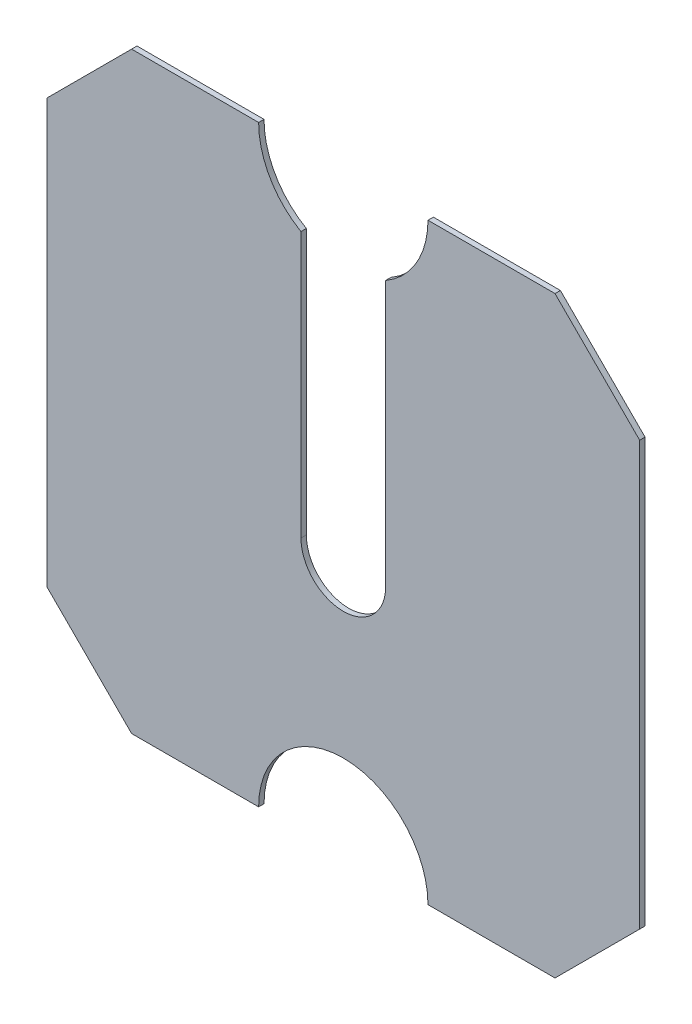
ISO-10303-21;
HEADER;
FILE_DESCRIPTION(('STEP AP214'),'2;1');
FILE_NAME('part.step','',(''),(''),'','','');
FILE_SCHEMA(('AUTOMOTIVE_DESIGN { 1 0 10303 214 1 1 1 1 }'));
ENDSEC;
DATA;
#1=APPLICATION_CONTEXT('core data for automotive mechanical design processes');
#2=APPLICATION_PROTOCOL_DEFINITION('international standard','automotive_design',2000,#1);
#3=PRODUCT_CONTEXT('',#1,'mechanical');
#4=PRODUCT('Part','Part','',(#3));
#5=PRODUCT_RELATED_PRODUCT_CATEGORY('part','',(#4));
#6=PRODUCT_DEFINITION_FORMATION('','',#4);
#7=PRODUCT_DEFINITION_CONTEXT('part definition',#1,'design');
#8=PRODUCT_DEFINITION('design','',#6,#7);
#9=PRODUCT_DEFINITION_SHAPE('','',#8);
#10=(LENGTH_UNIT() NAMED_UNIT(*) SI_UNIT(.MILLI.,.METRE.));
#11=(NAMED_UNIT(*) PLANE_ANGLE_UNIT() SI_UNIT($,.RADIAN.));
#12=(NAMED_UNIT(*) SI_UNIT($,.STERADIAN.) SOLID_ANGLE_UNIT());
#13=UNCERTAINTY_MEASURE_WITH_UNIT(LENGTH_MEASURE(1.E-05),#10,'distance_accuracy_value','');
#14=(GEOMETRIC_REPRESENTATION_CONTEXT(3) GLOBAL_UNCERTAINTY_ASSIGNED_CONTEXT((#13)) GLOBAL_UNIT_ASSIGNED_CONTEXT((#10,
#11,#12)) REPRESENTATION_CONTEXT('',''));
#15=CARTESIAN_POINT('',(0.,0.,0.));
#16=DIRECTION('',(0.,0.,1.));
#17=DIRECTION('',(1.,0.,0.));
#18=AXIS2_PLACEMENT_3D('',#15,#16,#17);
#19=CARTESIAN_POINT('',(0.,350.,3.175));
#20=DIRECTION('',(0.,0.,-1.));
#21=DIRECTION('',(-1.,0.,0.));
#22=AXIS2_PLACEMENT_3D('',#19,#20,#21);
#23=CYLINDRICAL_SURFACE('',#22,50.);
#24=CARTESIAN_POINT('',(0.,350.,0.));
#25=DIRECTION('',(0.,0.,-1.));
#26=DIRECTION('',(-1.,0.,0.));
#27=AXIS2_PLACEMENT_3D('',#24,#25,#26);
#28=CIRCLE('',#27,50.);
#29=CARTESIAN_POINT('',(50.,350.,0.));
#30=VERTEX_POINT('',#29);
#31=CARTESIAN_POINT('',(25.,306.698729810778,0.));
#32=VERTEX_POINT('',#31);
#33=EDGE_CURVE('E178',#30,#32,#28,.T.);
#34=ORIENTED_EDGE('',*,*,#33,.T.);
#35=DIRECTION('',(0.,0.,1.));
#36=VECTOR('',#35,1.);
#37=CARTESIAN_POINT('',(25.,306.698729810778,0.));
#38=LINE('',#37,#36);
#39=CARTESIAN_POINT('',(25.,306.698729810778,3.175));
#40=VERTEX_POINT('',#39);
#41=EDGE_CURVE('E171',#32,#40,#38,.T.);
#42=ORIENTED_EDGE('',*,*,#41,.T.);
#43=CARTESIAN_POINT('',(0.,350.,3.175));
#44=DIRECTION('',(0.,0.,-1.));
#45=DIRECTION('',(-1.,0.,0.));
#46=AXIS2_PLACEMENT_3D('',#43,#44,#45);
#47=CIRCLE('',#46,50.);
#48=CARTESIAN_POINT('',(50.,350.,3.175));
#49=VERTEX_POINT('',#48);
#50=EDGE_CURVE('E235',#49,#40,#47,.T.);
#51=ORIENTED_EDGE('',*,*,#50,.F.);
#52=DIRECTION('',(0.,0.,-1.));
#53=VECTOR('',#52,1.);
#54=CARTESIAN_POINT('',(50.,350.,3.175));
#55=LINE('',#54,#53);
#56=EDGE_CURVE('E209',#49,#30,#55,.T.);
#57=ORIENTED_EDGE('',*,*,#56,.T.);
#58=EDGE_LOOP('',(#34,#42,#51,#57));
#59=FACE_BOUND('',#58,.T.);
#60=ADVANCED_FACE('F33',(#59),#23,.F.);
#61=CARTESIAN_POINT('',(175.,50.,3.175));
#62=DIRECTION('',(-0.707106781186548,0.707106781186547,0.));
#63=DIRECTION('',(-0.707106781186547,-0.707106781186548,0.));
#64=AXIS2_PLACEMENT_3D('',#61,#62,#63);
#65=PLANE('',#64);
#66=DIRECTION('',(0.707106781186547,0.707106781186548,0.));
#67=VECTOR('',#66,1.);
#68=CARTESIAN_POINT('',(175.,50.,0.));
#69=LINE('',#68,#67);
#70=CARTESIAN_POINT('',(125.,0.,0.));
#71=VERTEX_POINT('',#70);
#72=CARTESIAN_POINT('',(175.,50.,0.));
#73=VERTEX_POINT('',#72);
#74=EDGE_CURVE('E167',#71,#73,#69,.T.);
#75=ORIENTED_EDGE('',*,*,#74,.T.);
#76=DIRECTION('',(0.,0.,-1.));
#77=VECTOR('',#76,1.);
#78=CARTESIAN_POINT('',(175.,50.,3.175));
#79=LINE('',#78,#77);
#80=CARTESIAN_POINT('',(175.,50.,3.175));
#81=VERTEX_POINT('',#80);
#82=EDGE_CURVE('E11',#81,#73,#79,.T.);
#83=ORIENTED_EDGE('',*,*,#82,.F.);
#84=DIRECTION('',(0.707106781186547,0.707106781186548,0.));
#85=VECTOR('',#84,1.);
#86=CARTESIAN_POINT('',(175.,50.,3.175));
#87=LINE('',#86,#85);
#88=CARTESIAN_POINT('',(125.,0.,3.175));
#89=VERTEX_POINT('',#88);
#90=EDGE_CURVE('E193',#89,#81,#87,.T.);
#91=ORIENTED_EDGE('',*,*,#90,.F.);
#92=DIRECTION('',(0.,0.,-1.));
#93=VECTOR('',#92,1.);
#94=CARTESIAN_POINT('',(125.,0.,3.175));
#95=LINE('',#94,#93);
#96=EDGE_CURVE('E163',#89,#71,#95,.T.);
#97=ORIENTED_EDGE('',*,*,#96,.T.);
#98=EDGE_LOOP('',(#75,#83,#91,#97));
#99=FACE_BOUND('',#98,.T.);
#100=ADVANCED_FACE('F35',(#99),#65,.F.);
#101=CARTESIAN_POINT('',(175.,300.,3.175));
#102=DIRECTION('',(-1.,0.,0.));
#103=DIRECTION('',(0.,-1.,0.));
#104=AXIS2_PLACEMENT_3D('',#101,#102,#103);
#105=PLANE('',#104);
#106=DIRECTION('',(0.,1.,0.));
#107=VECTOR('',#106,1.);
#108=CARTESIAN_POINT('',(175.,300.,0.));
#109=LINE('',#108,#107);
#110=CARTESIAN_POINT('',(175.,300.,0.));
#111=VERTEX_POINT('',#110);
#112=EDGE_CURVE('E170',#73,#111,#109,.T.);
#113=ORIENTED_EDGE('',*,*,#112,.T.);
#114=DIRECTION('',(0.,0.,-1.));
#115=VECTOR('',#114,1.);
#116=CARTESIAN_POINT('',(175.,300.,3.175));
#117=LINE('',#116,#115);
#118=CARTESIAN_POINT('',(175.,300.,3.175));
#119=VERTEX_POINT('',#118);
#120=EDGE_CURVE('E41',#119,#111,#117,.T.);
#121=ORIENTED_EDGE('',*,*,#120,.F.);
#122=DIRECTION('',(0.,1.,0.));
#123=VECTOR('',#122,1.);
#124=CARTESIAN_POINT('',(175.,300.,3.175));
#125=LINE('',#124,#123);
#126=EDGE_CURVE('E110',#81,#119,#125,.T.);
#127=ORIENTED_EDGE('',*,*,#126,.F.);
#128=ORIENTED_EDGE('',*,*,#82,.T.);
#129=EDGE_LOOP('',(#113,#121,#127,#128));
#130=FACE_BOUND('',#129,.T.);
#131=ADVANCED_FACE('F329',(#130),#105,.F.);
#132=CARTESIAN_POINT('',(175.,300.,3.175));
#133=DIRECTION('',(-0.707106781186548,-0.707106781186547,0.));
#134=DIRECTION('',(0.707106781186547,-0.707106781186548,0.));
#135=AXIS2_PLACEMENT_3D('',#132,#133,#134);
#136=PLANE('',#135);
#137=DIRECTION('',(-0.707106781186547,0.707106781186548,0.));
#138=VECTOR('',#137,1.);
#139=CARTESIAN_POINT('',(175.,300.,0.));
#140=LINE('',#139,#138);
#141=CARTESIAN_POINT('',(125.,350.,0.));
#142=VERTEX_POINT('',#141);
#143=EDGE_CURVE('E173',#111,#142,#140,.T.);
#144=ORIENTED_EDGE('',*,*,#143,.T.);
#145=DIRECTION('',(0.,0.,-1.));
#146=VECTOR('',#145,1.);
#147=CARTESIAN_POINT('',(125.,350.,3.175));
#148=LINE('',#147,#146);
#149=CARTESIAN_POINT('',(125.,350.,3.175));
#150=VERTEX_POINT('',#149);
#151=EDGE_CURVE('E212',#150,#142,#148,.T.);
#152=ORIENTED_EDGE('',*,*,#151,.F.);
#153=DIRECTION('',(-0.707106781186547,0.707106781186548,0.));
#154=VECTOR('',#153,1.);
#155=CARTESIAN_POINT('',(175.,300.,3.175));
#156=LINE('',#155,#154);
#157=EDGE_CURVE('E220',#119,#150,#156,.T.);
#158=ORIENTED_EDGE('',*,*,#157,.F.);
#159=ORIENTED_EDGE('',*,*,#120,.T.);
#160=EDGE_LOOP('',(#144,#152,#158,#159));
#161=FACE_BOUND('',#160,.T.);
#162=ADVANCED_FACE('F218',(#161),#136,.F.);
#163=CARTESIAN_POINT('',(125.,350.,3.175));
#164=DIRECTION('',(0.,-1.,0.));
#165=DIRECTION('',(0.,0.,-1.));
#166=AXIS2_PLACEMENT_3D('',#163,#164,#165);
#167=PLANE('',#166);
#168=DIRECTION('',(-1.,0.,0.));
#169=VECTOR('',#168,1.);
#170=CARTESIAN_POINT('',(125.,350.,0.));
#171=LINE('',#170,#169);
#172=EDGE_CURVE('E175',#142,#30,#171,.T.);
#173=ORIENTED_EDGE('',*,*,#172,.T.);
#174=ORIENTED_EDGE('',*,*,#56,.F.);
#175=DIRECTION('',(-1.,0.,0.));
#176=VECTOR('',#175,1.);
#177=CARTESIAN_POINT('',(125.,350.,3.175));
#178=LINE('',#177,#176);
#179=EDGE_CURVE('E242',#150,#49,#178,.T.);
#180=ORIENTED_EDGE('',*,*,#179,.F.);
#181=ORIENTED_EDGE('',*,*,#151,.T.);
#182=EDGE_LOOP('',(#173,#174,#180,#181));
#183=FACE_BOUND('',#182,.T.);
#184=ADVANCED_FACE('F229',(#183),#167,.F.);
#185=CARTESIAN_POINT('',(-25.,306.698729810778,3.175));
#186=VERTEX_POINT('',#185);
#187=CARTESIAN_POINT('',(-50.,350.,3.175));
#188=VERTEX_POINT('',#187);
#189=EDGE_CURVE('E238',#186,#188,#47,.T.);
#190=ORIENTED_EDGE('',*,*,#189,.F.);
#191=DIRECTION('',(0.,0.,1.));
#192=VECTOR('',#191,1.);
#193=CARTESIAN_POINT('',(-25.,306.698729810778,0.));
#194=LINE('',#193,#192);
#195=CARTESIAN_POINT('',(-25.,306.698729810778,0.));
#196=VERTEX_POINT('',#195);
#197=EDGE_CURVE('E265',#196,#186,#194,.T.);
#198=ORIENTED_EDGE('',*,*,#197,.F.);
#199=CARTESIAN_POINT('',(-50.,350.,0.));
#200=VERTEX_POINT('',#199);
#201=EDGE_CURVE('E177',#196,#200,#28,.T.);
#202=ORIENTED_EDGE('',*,*,#201,.T.);
#203=DIRECTION('',(0.,0.,-1.));
#204=VECTOR('',#203,1.);
#205=CARTESIAN_POINT('',(-50.,350.,3.175));
#206=LINE('',#205,#204);
#207=EDGE_CURVE('E206',#188,#200,#206,.T.);
#208=ORIENTED_EDGE('',*,*,#207,.F.);
#209=EDGE_LOOP('',(#190,#198,#202,#208));
#210=FACE_BOUND('',#209,.T.);
#211=ADVANCED_FACE('F301',(#210),#23,.F.);
#212=CARTESIAN_POINT('',(-125.,350.,3.175));
#213=DIRECTION('',(0.,-1.,0.));
#214=DIRECTION('',(0.,0.,-1.));
#215=AXIS2_PLACEMENT_3D('',#212,#213,#214);
#216=PLANE('',#215);
#217=DIRECTION('',(-1.,0.,0.));
#218=VECTOR('',#217,1.);
#219=CARTESIAN_POINT('',(-125.,350.,0.));
#220=LINE('',#219,#218);
#221=CARTESIAN_POINT('',(-125.,350.,0.));
#222=VERTEX_POINT('',#221);
#223=EDGE_CURVE('E181',#200,#222,#220,.T.);
#224=ORIENTED_EDGE('',*,*,#223,.T.);
#225=DIRECTION('',(0.,0.,-1.));
#226=VECTOR('',#225,1.);
#227=CARTESIAN_POINT('',(-125.,350.,3.175));
#228=LINE('',#227,#226);
#229=CARTESIAN_POINT('',(-125.,350.,3.175));
#230=VERTEX_POINT('',#229);
#231=EDGE_CURVE('E203',#230,#222,#228,.T.);
#232=ORIENTED_EDGE('',*,*,#231,.F.);
#233=DIRECTION('',(-1.,0.,0.));
#234=VECTOR('',#233,1.);
#235=CARTESIAN_POINT('',(-125.,350.,3.175));
#236=LINE('',#235,#234);
#237=EDGE_CURVE('E237',#188,#230,#236,.T.);
#238=ORIENTED_EDGE('',*,*,#237,.F.);
#239=ORIENTED_EDGE('',*,*,#207,.T.);
#240=EDGE_LOOP('',(#224,#232,#238,#239));
#241=FACE_BOUND('',#240,.T.);
#242=ADVANCED_FACE('F333',(#241),#216,.F.);
#243=CARTESIAN_POINT('',(-175.,300.,3.175));
#244=DIRECTION('',(0.707106781186547,-0.707106781186548,0.));
#245=DIRECTION('',(0.707106781186548,0.707106781186547,0.));
#246=AXIS2_PLACEMENT_3D('',#243,#244,#245);
#247=PLANE('',#246);
#248=DIRECTION('',(-0.707106781186548,-0.707106781186547,0.));
#249=VECTOR('',#248,1.);
#250=CARTESIAN_POINT('',(-175.,300.,0.));
#251=LINE('',#250,#249);
#252=CARTESIAN_POINT('',(-175.,300.,0.));
#253=VERTEX_POINT('',#252);
#254=EDGE_CURVE('E183',#222,#253,#251,.T.);
#255=ORIENTED_EDGE('',*,*,#254,.T.);
#256=DIRECTION('',(0.,0.,-1.));
#257=VECTOR('',#256,1.);
#258=CARTESIAN_POINT('',(-175.,300.,3.175));
#259=LINE('',#258,#257);
#260=CARTESIAN_POINT('',(-175.,300.,3.175));
#261=VERTEX_POINT('',#260);
#262=EDGE_CURVE('E200',#261,#253,#259,.T.);
#263=ORIENTED_EDGE('',*,*,#262,.F.);
#264=DIRECTION('',(-0.707106781186548,-0.707106781186547,0.));
#265=VECTOR('',#264,1.);
#266=CARTESIAN_POINT('',(-175.,300.,3.175));
#267=LINE('',#266,#265);
#268=EDGE_CURVE('E240',#230,#261,#267,.T.);
#269=ORIENTED_EDGE('',*,*,#268,.F.);
#270=ORIENTED_EDGE('',*,*,#231,.T.);
#271=EDGE_LOOP('',(#255,#263,#269,#270));
#272=FACE_BOUND('',#271,.T.);
#273=ADVANCED_FACE('F338',(#272),#247,.F.);
#274=CARTESIAN_POINT('',(-175.,300.,3.175));
#275=DIRECTION('',(1.,0.,0.));
#276=DIRECTION('',(0.,0.,-1.));
#277=AXIS2_PLACEMENT_3D('',#274,#275,#276);
#278=PLANE('',#277);
#279=DIRECTION('',(0.,-1.,0.));
#280=VECTOR('',#279,1.);
#281=CARTESIAN_POINT('',(-175.,300.,0.));
#282=LINE('',#281,#280);
#283=CARTESIAN_POINT('',(-175.,50.0000000000001,0.));
#284=VERTEX_POINT('',#283);
#285=EDGE_CURVE('E185',#253,#284,#282,.T.);
#286=ORIENTED_EDGE('',*,*,#285,.T.);
#287=DIRECTION('',(0.,0.,-1.));
#288=VECTOR('',#287,1.);
#289=CARTESIAN_POINT('',(-175.,50.0000000000001,3.175));
#290=LINE('',#289,#288);
#291=CARTESIAN_POINT('',(-175.,50.0000000000001,3.175));
#292=VERTEX_POINT('',#291);
#293=EDGE_CURVE('E197',#292,#284,#290,.T.);
#294=ORIENTED_EDGE('',*,*,#293,.F.);
#295=DIRECTION('',(0.,-1.,0.));
#296=VECTOR('',#295,1.);
#297=CARTESIAN_POINT('',(-175.,300.,3.175));
#298=LINE('',#297,#296);
#299=EDGE_CURVE('E247',#261,#292,#298,.T.);
#300=ORIENTED_EDGE('',*,*,#299,.F.);
#301=ORIENTED_EDGE('',*,*,#262,.T.);
#302=EDGE_LOOP('',(#286,#294,#300,#301));
#303=FACE_BOUND('',#302,.T.);
#304=ADVANCED_FACE('F253',(#303),#278,.F.);
#305=CARTESIAN_POINT('',(-175.,50.0000000000001,3.175));
#306=DIRECTION('',(0.707106781186548,0.707106781186547,0.));
#307=DIRECTION('',(-0.707106781186547,0.707106781186548,0.));
#308=AXIS2_PLACEMENT_3D('',#305,#306,#307);
#309=PLANE('',#308);
#310=DIRECTION('',(0.707106781186547,-0.707106781186548,0.));
#311=VECTOR('',#310,1.);
#312=CARTESIAN_POINT('',(-175.,50.0000000000001,0.));
#313=LINE('',#312,#311);
#314=CARTESIAN_POINT('',(-125.,0.,0.));
#315=VERTEX_POINT('',#314);
#316=EDGE_CURVE('E187',#284,#315,#313,.T.);
#317=ORIENTED_EDGE('',*,*,#316,.T.);
#318=DIRECTION('',(0.,0.,-1.));
#319=VECTOR('',#318,1.);
#320=CARTESIAN_POINT('',(-125.,0.,3.175));
#321=LINE('',#320,#319);
#322=CARTESIAN_POINT('',(-125.,0.,3.175));
#323=VERTEX_POINT('',#322);
#324=EDGE_CURVE('E158',#323,#315,#321,.T.);
#325=ORIENTED_EDGE('',*,*,#324,.F.);
#326=DIRECTION('',(0.707106781186547,-0.707106781186548,0.));
#327=VECTOR('',#326,1.);
#328=CARTESIAN_POINT('',(-175.,50.0000000000001,3.175));
#329=LINE('',#328,#327);
#330=EDGE_CURVE('E146',#292,#323,#329,.T.);
#331=ORIENTED_EDGE('',*,*,#330,.F.);
#332=ORIENTED_EDGE('',*,*,#293,.T.);
#333=EDGE_LOOP('',(#317,#325,#331,#332));
#334=FACE_BOUND('',#333,.T.);
#335=ADVANCED_FACE('F257',(#334),#309,.F.);
#336=CARTESIAN_POINT('',(-125.,0.,3.175));
#337=DIRECTION('',(0.,1.,0.));
#338=DIRECTION('',(-1.,0.,0.));
#339=AXIS2_PLACEMENT_3D('',#336,#337,#338);
#340=PLANE('',#339);
#341=DIRECTION('',(1.,0.,0.));
#342=VECTOR('',#341,1.);
#343=CARTESIAN_POINT('',(-125.,0.,0.));
#344=LINE('',#343,#342);
#345=CARTESIAN_POINT('',(-50.,0.,0.));
#346=VERTEX_POINT('',#345);
#347=EDGE_CURVE('E155',#315,#346,#344,.T.);
#348=ORIENTED_EDGE('',*,*,#347,.T.);
#349=DIRECTION('',(0.,0.,-1.));
#350=VECTOR('',#349,1.);
#351=CARTESIAN_POINT('',(-50.,0.,3.175));
#352=LINE('',#351,#350);
#353=CARTESIAN_POINT('',(-50.,0.,3.175));
#354=VERTEX_POINT('',#353);
#355=EDGE_CURVE('E152',#354,#346,#352,.T.);
#356=ORIENTED_EDGE('',*,*,#355,.F.);
#357=DIRECTION('',(1.,0.,0.));
#358=VECTOR('',#357,1.);
#359=CARTESIAN_POINT('',(-125.,0.,3.175));
#360=LINE('',#359,#358);
#361=EDGE_CURVE('E138',#323,#354,#360,.T.);
#362=ORIENTED_EDGE('',*,*,#361,.F.);
#363=ORIENTED_EDGE('',*,*,#324,.T.);
#364=EDGE_LOOP('',(#348,#356,#362,#363));
#365=FACE_BOUND('',#364,.T.);
#366=ADVANCED_FACE('F153',(#365),#340,.F.);
#367=CARTESIAN_POINT('',(0.,0.,3.175));
#368=DIRECTION('',(0.,0.,-1.));
#369=DIRECTION('',(-1.,0.,0.));
#370=AXIS2_PLACEMENT_3D('',#367,#368,#369);
#371=CYLINDRICAL_SURFACE('',#370,50.);
#372=CARTESIAN_POINT('',(0.,0.,0.));
#373=DIRECTION('',(0.,0.,-1.));
#374=DIRECTION('',(1.,0.,0.));
#375=AXIS2_PLACEMENT_3D('',#372,#373,#374);
#376=CIRCLE('',#375,50.);
#377=CARTESIAN_POINT('',(50.,0.,0.));
#378=VERTEX_POINT('',#377);
#379=EDGE_CURVE('E190',#346,#378,#376,.T.);
#380=ORIENTED_EDGE('',*,*,#379,.T.);
#381=DIRECTION('',(0.,0.,-1.));
#382=VECTOR('',#381,1.);
#383=CARTESIAN_POINT('',(50.,0.,3.175));
#384=LINE('',#383,#382);
#385=CARTESIAN_POINT('',(50.,0.,3.175));
#386=VERTEX_POINT('',#385);
#387=EDGE_CURVE('E159',#386,#378,#384,.T.);
#388=ORIENTED_EDGE('',*,*,#387,.F.);
#389=CARTESIAN_POINT('',(0.,0.,3.175));
#390=DIRECTION('',(0.,0.,-1.));
#391=DIRECTION('',(1.,0.,0.));
#392=AXIS2_PLACEMENT_3D('',#389,#390,#391);
#393=CIRCLE('',#392,50.);
#394=EDGE_CURVE('E143',#354,#386,#393,.T.);
#395=ORIENTED_EDGE('',*,*,#394,.F.);
#396=ORIENTED_EDGE('',*,*,#355,.T.);
#397=EDGE_LOOP('',(#380,#388,#395,#396));
#398=FACE_BOUND('',#397,.T.);
#399=ADVANCED_FACE('F161',(#398),#371,.F.);
#400=CARTESIAN_POINT('',(125.,0.,3.175));
#401=DIRECTION('',(0.,1.,0.));
#402=DIRECTION('',(-1.,0.,0.));
#403=AXIS2_PLACEMENT_3D('',#400,#401,#402);
#404=PLANE('',#403);
#405=DIRECTION('',(1.,0.,0.));
#406=VECTOR('',#405,1.);
#407=CARTESIAN_POINT('',(125.,0.,0.));
#408=LINE('',#407,#406);
#409=EDGE_CURVE('E102',#378,#71,#408,.T.);
#410=ORIENTED_EDGE('',*,*,#409,.T.);
#411=ORIENTED_EDGE('',*,*,#96,.F.);
#412=DIRECTION('',(1.,0.,0.));
#413=VECTOR('',#412,1.);
#414=CARTESIAN_POINT('',(125.,0.,3.175));
#415=LINE('',#414,#413);
#416=EDGE_CURVE('E57',#386,#89,#415,.T.);
#417=ORIENTED_EDGE('',*,*,#416,.F.);
#418=ORIENTED_EDGE('',*,*,#387,.T.);
#419=EDGE_LOOP('',(#410,#411,#417,#418));
#420=FACE_BOUND('',#419,.T.);
#421=ADVANCED_FACE('F258',(#420),#404,.F.);
#422=CARTESIAN_POINT('',(0.,0.,3.175));
#423=DIRECTION('',(0.,0.,1.));
#424=DIRECTION('',(1.,0.,0.));
#425=AXIS2_PLACEMENT_3D('',#422,#423,#424);
#426=PLANE('',#425);
#427=DIRECTION('',(0.,1.,0.));
#428=VECTOR('',#427,1.);
#429=CARTESIAN_POINT('',(25.,150.,3.175));
#430=LINE('',#429,#428);
#431=CARTESIAN_POINT('',(25.,150.,3.175));
#432=VERTEX_POINT('',#431);
#433=EDGE_CURVE('E275',#432,#40,#430,.T.);
#434=ORIENTED_EDGE('',*,*,#433,.F.);
#435=CARTESIAN_POINT('',(0.,150.,3.175));
#436=DIRECTION('',(0.,0.,1.));
#437=DIRECTION('',(1.,0.,0.));
#438=AXIS2_PLACEMENT_3D('',#435,#436,#437);
#439=CIRCLE('',#438,25.);
#440=CARTESIAN_POINT('',(-25.,150.,3.175));
#441=VERTEX_POINT('',#440);
#442=EDGE_CURVE('E279',#441,#432,#439,.T.);
#443=ORIENTED_EDGE('',*,*,#442,.F.);
#444=DIRECTION('',(0.,-1.,0.));
#445=VECTOR('',#444,1.);
#446=CARTESIAN_POINT('',(-25.,306.698729810778,3.175));
#447=LINE('',#446,#445);
#448=EDGE_CURVE('E282',#186,#441,#447,.T.);
#449=ORIENTED_EDGE('',*,*,#448,.F.);
#450=ORIENTED_EDGE('',*,*,#189,.T.);
#451=ORIENTED_EDGE('',*,*,#237,.T.);
#452=ORIENTED_EDGE('',*,*,#268,.T.);
#453=ORIENTED_EDGE('',*,*,#299,.T.);
#454=ORIENTED_EDGE('',*,*,#330,.T.);
#455=ORIENTED_EDGE('',*,*,#361,.T.);
#456=ORIENTED_EDGE('',*,*,#394,.T.);
#457=ORIENTED_EDGE('',*,*,#416,.T.);
#458=ORIENTED_EDGE('',*,*,#90,.T.);
#459=ORIENTED_EDGE('',*,*,#126,.T.);
#460=ORIENTED_EDGE('',*,*,#157,.T.);
#461=ORIENTED_EDGE('',*,*,#179,.T.);
#462=ORIENTED_EDGE('',*,*,#50,.T.);
#463=EDGE_LOOP('',(#434,#443,#449,#450,#451,#452,#453,#454,#455,#456,#457,#458,#459,#460,#461,#462));
#464=FACE_BOUND('',#463,.T.);
#465=ADVANCED_FACE('F141',(#464),#426,.T.);
#466=CARTESIAN_POINT('',(0.,0.,0.));
#467=DIRECTION('',(0.,0.,1.));
#468=DIRECTION('',(1.,0.,0.));
#469=AXIS2_PLACEMENT_3D('',#466,#467,#468);
#470=PLANE('',#469);
#471=CARTESIAN_POINT('',(0.,150.,0.));
#472=DIRECTION('',(0.,0.,1.));
#473=DIRECTION('',(1.,0.,0.));
#474=AXIS2_PLACEMENT_3D('',#471,#472,#473);
#475=CIRCLE('',#474,25.);
#476=CARTESIAN_POINT('',(-25.,150.,0.));
#477=VERTEX_POINT('',#476);
#478=CARTESIAN_POINT('',(25.,150.,0.));
#479=VERTEX_POINT('',#478);
#480=EDGE_CURVE('E48',#477,#479,#475,.T.);
#481=ORIENTED_EDGE('',*,*,#480,.T.);
#482=DIRECTION('',(0.,1.,0.));
#483=VECTOR('',#482,1.);
#484=CARTESIAN_POINT('',(25.,150.,0.));
#485=LINE('',#484,#483);
#486=EDGE_CURVE('E269',#479,#32,#485,.T.);
#487=ORIENTED_EDGE('',*,*,#486,.T.);
#488=ORIENTED_EDGE('',*,*,#33,.F.);
#489=ORIENTED_EDGE('',*,*,#172,.F.);
#490=ORIENTED_EDGE('',*,*,#143,.F.);
#491=ORIENTED_EDGE('',*,*,#112,.F.);
#492=ORIENTED_EDGE('',*,*,#74,.F.);
#493=ORIENTED_EDGE('',*,*,#409,.F.);
#494=ORIENTED_EDGE('',*,*,#379,.F.);
#495=ORIENTED_EDGE('',*,*,#347,.F.);
#496=ORIENTED_EDGE('',*,*,#316,.F.);
#497=ORIENTED_EDGE('',*,*,#285,.F.);
#498=ORIENTED_EDGE('',*,*,#254,.F.);
#499=ORIENTED_EDGE('',*,*,#223,.F.);
#500=ORIENTED_EDGE('',*,*,#201,.F.);
#501=DIRECTION('',(0.,-1.,0.));
#502=VECTOR('',#501,1.);
#503=CARTESIAN_POINT('',(-25.,306.698729810778,0.));
#504=LINE('',#503,#502);
#505=EDGE_CURVE('E278',#196,#477,#504,.T.);
#506=ORIENTED_EDGE('',*,*,#505,.T.);
#507=EDGE_LOOP('',(#481,#487,#488,#489,#490,#491,#492,#493,#494,#495,#496,#497,#498,#499,#500,#506));
#508=FACE_BOUND('',#507,.T.);
#509=ADVANCED_FACE('F223',(#508),#470,.F.);
#510=CARTESIAN_POINT('',(25.,150.,0.));
#511=DIRECTION('',(1.,0.,0.));
#512=DIRECTION('',(0.,1.,0.));
#513=AXIS2_PLACEMENT_3D('',#510,#511,#512);
#514=PLANE('',#513);
#515=ORIENTED_EDGE('',*,*,#433,.T.);
#516=ORIENTED_EDGE('',*,*,#41,.F.);
#517=ORIENTED_EDGE('',*,*,#486,.F.);
#518=DIRECTION('',(0.,0.,1.));
#519=VECTOR('',#518,1.);
#520=CARTESIAN_POINT('',(25.,150.,0.));
#521=LINE('',#520,#519);
#522=EDGE_CURVE('E271',#479,#432,#521,.T.);
#523=ORIENTED_EDGE('',*,*,#522,.T.);
#524=EDGE_LOOP('',(#515,#516,#517,#523));
#525=FACE_BOUND('',#524,.T.);
#526=ADVANCED_FACE('F315',(#525),#514,.F.);
#527=CARTESIAN_POINT('',(0.,150.,0.));
#528=DIRECTION('',(0.,0.,1.));
#529=DIRECTION('',(1.,0.,0.));
#530=AXIS2_PLACEMENT_3D('',#527,#528,#529);
#531=CYLINDRICAL_SURFACE('',#530,25.);
#532=ORIENTED_EDGE('',*,*,#442,.T.);
#533=ORIENTED_EDGE('',*,*,#522,.F.);
#534=ORIENTED_EDGE('',*,*,#480,.F.);
#535=DIRECTION('',(0.,0.,1.));
#536=VECTOR('',#535,1.);
#537=CARTESIAN_POINT('',(-25.,150.,0.));
#538=LINE('',#537,#536);
#539=EDGE_CURVE('E268',#477,#441,#538,.T.);
#540=ORIENTED_EDGE('',*,*,#539,.T.);
#541=EDGE_LOOP('',(#532,#533,#534,#540));
#542=FACE_BOUND('',#541,.T.);
#543=ADVANCED_FACE('F313',(#542),#531,.F.);
#544=CARTESIAN_POINT('',(-25.,306.698729810778,0.));
#545=DIRECTION('',(-1.,0.,0.));
#546=DIRECTION('',(0.,-1.,0.));
#547=AXIS2_PLACEMENT_3D('',#544,#545,#546);
#548=PLANE('',#547);
#549=ORIENTED_EDGE('',*,*,#448,.T.);
#550=ORIENTED_EDGE('',*,*,#539,.F.);
#551=ORIENTED_EDGE('',*,*,#505,.F.);
#552=ORIENTED_EDGE('',*,*,#197,.T.);
#553=EDGE_LOOP('',(#549,#550,#551,#552));
#554=FACE_BOUND('',#553,.T.);
#555=ADVANCED_FACE('F295',(#554),#548,.F.);
#556=CLOSED_SHELL('',(#60,#100,#131,#162,#184,#211,#242,#273,#304,#335,#366,#399,#421,#465,#509,
#526,#543,#555));
#557=MANIFOLD_SOLID_BREP('B2',#556);
#558=ADVANCED_BREP_SHAPE_REPRESENTATION('',(#18,#557),#14);
#559=SHAPE_DEFINITION_REPRESENTATION(#9,#558);
ENDSEC;
END-ISO-10303-21;
